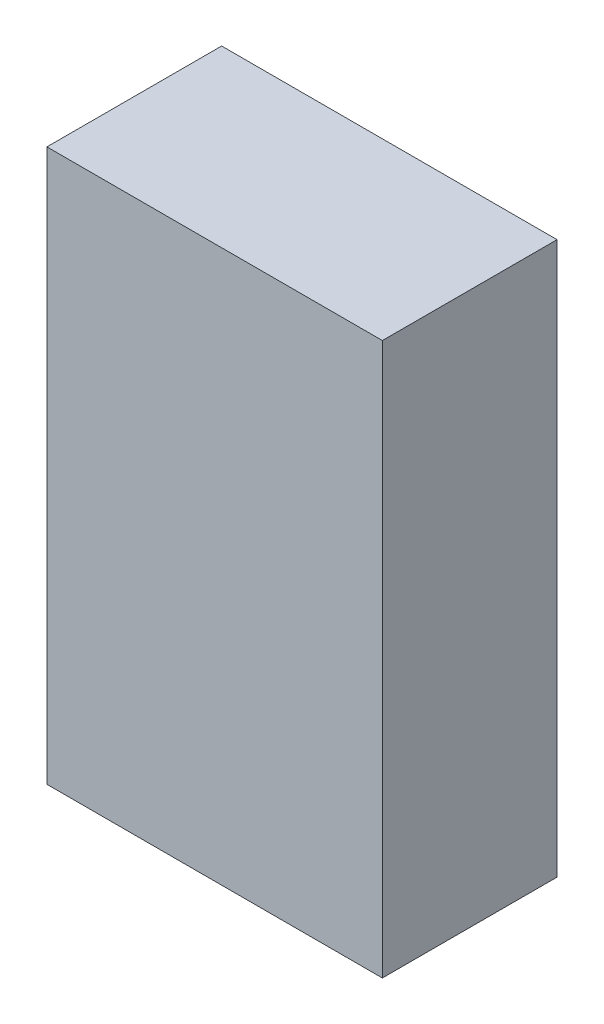
ISO-10303-21;
HEADER;
FILE_DESCRIPTION(('STEP AP214'),'2;1');
FILE_NAME('part.step','',(''),(''),'','','');
FILE_SCHEMA(('AUTOMOTIVE_DESIGN { 1 0 10303 214 1 1 1 1 }'));
ENDSEC;
DATA;
#1=APPLICATION_CONTEXT('core data for automotive mechanical design processes');
#2=APPLICATION_PROTOCOL_DEFINITION('international standard','automotive_design',2000,#1);
#3=PRODUCT_CONTEXT('',#1,'mechanical');
#4=PRODUCT('Part','Part','',(#3));
#5=PRODUCT_RELATED_PRODUCT_CATEGORY('part','',(#4));
#6=PRODUCT_DEFINITION_FORMATION('','',#4);
#7=PRODUCT_DEFINITION_CONTEXT('part definition',#1,'design');
#8=PRODUCT_DEFINITION('design','',#6,#7);
#9=PRODUCT_DEFINITION_SHAPE('','',#8);
#10=(LENGTH_UNIT() NAMED_UNIT(*) SI_UNIT(.MILLI.,.METRE.));
#11=(NAMED_UNIT(*) PLANE_ANGLE_UNIT() SI_UNIT($,.RADIAN.));
#12=(NAMED_UNIT(*) SI_UNIT($,.STERADIAN.) SOLID_ANGLE_UNIT());
#13=UNCERTAINTY_MEASURE_WITH_UNIT(LENGTH_MEASURE(1.E-05),#10,'distance_accuracy_value','');
#14=(GEOMETRIC_REPRESENTATION_CONTEXT(3) GLOBAL_UNCERTAINTY_ASSIGNED_CONTEXT((#13)) GLOBAL_UNIT_ASSIGNED_CONTEXT((#10,
#11,#12)) REPRESENTATION_CONTEXT('',''));
#15=CARTESIAN_POINT('',(0.,0.,0.));
#16=DIRECTION('',(0.,0.,1.));
#17=DIRECTION('',(1.,0.,0.));
#18=AXIS2_PLACEMENT_3D('',#15,#16,#17);
#19=CARTESIAN_POINT('',(-0.6096,-1.0033,0.635));
#20=DIRECTION('',(0.,0.,1.));
#21=DIRECTION('',(1.,0.,0.));
#22=AXIS2_PLACEMENT_3D('',#19,#20,#21);
#23=PLANE('',#22);
#24=DIRECTION('',(1.,0.,0.));
#25=VECTOR('',#24,1.);
#26=CARTESIAN_POINT('',(-0.6096,1.0033,0.635));
#27=LINE('',#26,#25);
#28=CARTESIAN_POINT('',(-0.6096,1.0033,0.635));
#29=VERTEX_POINT('',#28);
#30=CARTESIAN_POINT('',(0.6096,1.0033,0.635));
#31=VERTEX_POINT('',#30);
#32=EDGE_CURVE('E53',#29,#31,#27,.T.);
#33=ORIENTED_EDGE('',*,*,#32,.F.);
#34=DIRECTION('',(0.,1.,0.));
#35=VECTOR('',#34,1.);
#36=CARTESIAN_POINT('',(-0.6096,-1.0033,0.635));
#37=LINE('',#36,#35);
#38=CARTESIAN_POINT('',(-0.6096,-1.0033,0.635));
#39=VERTEX_POINT('',#38);
#40=EDGE_CURVE('E68',#39,#29,#37,.T.);
#41=ORIENTED_EDGE('',*,*,#40,.F.);
#42=DIRECTION('',(1.,0.,0.));
#43=VECTOR('',#42,1.);
#44=CARTESIAN_POINT('',(0.6096,-1.0033,0.635));
#45=LINE('',#44,#43);
#46=CARTESIAN_POINT('',(0.6096,-1.0033,0.635));
#47=VERTEX_POINT('',#46);
#48=EDGE_CURVE('E20',#47,#39,#45,.F.);
#49=ORIENTED_EDGE('',*,*,#48,.F.);
#50=DIRECTION('',(0.,1.,0.));
#51=VECTOR('',#50,1.);
#52=CARTESIAN_POINT('',(0.6096,1.0033,0.635));
#53=LINE('',#52,#51);
#54=EDGE_CURVE('E58',#31,#47,#53,.F.);
#55=ORIENTED_EDGE('',*,*,#54,.F.);
#56=EDGE_LOOP('',(#33,#41,#49,#55));
#57=FACE_BOUND('',#56,.T.);
#58=ADVANCED_FACE('F17',(#57),#23,.T.);
#59=CARTESIAN_POINT('',(0.6096,-1.0033,0.));
#60=DIRECTION('',(0.,-1.,0.));
#61=DIRECTION('',(0.,0.,-1.));
#62=AXIS2_PLACEMENT_3D('',#59,#60,#61);
#63=PLANE('',#62);
#64=DIRECTION('',(0.,0.,1.));
#65=VECTOR('',#64,1.);
#66=CARTESIAN_POINT('',(-0.6096,-1.0033,0.));
#67=LINE('',#66,#65);
#68=CARTESIAN_POINT('',(-0.6096,-1.0033,0.));
#69=VERTEX_POINT('',#68);
#70=EDGE_CURVE('E79',#69,#39,#67,.T.);
#71=ORIENTED_EDGE('',*,*,#70,.F.);
#72=DIRECTION('',(1.,0.,0.));
#73=VECTOR('',#72,1.);
#74=CARTESIAN_POINT('',(-0.6096,-1.0033,0.));
#75=LINE('',#74,#73);
#76=CARTESIAN_POINT('',(0.6096,-1.0033,0.));
#77=VERTEX_POINT('',#76);
#78=EDGE_CURVE('E74',#69,#77,#75,.T.);
#79=ORIENTED_EDGE('',*,*,#78,.T.);
#80=DIRECTION('',(0.,0.,-1.));
#81=VECTOR('',#80,1.);
#82=CARTESIAN_POINT('',(0.6096,-1.0033,0.));
#83=LINE('',#82,#81);
#84=EDGE_CURVE('E63',#47,#77,#83,.T.);
#85=ORIENTED_EDGE('',*,*,#84,.F.);
#86=ORIENTED_EDGE('',*,*,#48,.T.);
#87=EDGE_LOOP('',(#71,#79,#85,#86));
#88=FACE_BOUND('',#87,.T.);
#89=ADVANCED_FACE('F73',(#88),#63,.T.);
#90=CARTESIAN_POINT('',(0.6096,1.0033,0.));
#91=DIRECTION('',(1.,0.,0.));
#92=DIRECTION('',(0.,0.,-1.));
#93=AXIS2_PLACEMENT_3D('',#90,#91,#92);
#94=PLANE('',#93);
#95=ORIENTED_EDGE('',*,*,#84,.T.);
#96=DIRECTION('',(0.,1.,0.));
#97=VECTOR('',#96,1.);
#98=CARTESIAN_POINT('',(0.6096,-1.0033,0.));
#99=LINE('',#98,#97);
#100=CARTESIAN_POINT('',(0.6096,1.0033,0.));
#101=VERTEX_POINT('',#100);
#102=EDGE_CURVE('E84',#77,#101,#99,.T.);
#103=ORIENTED_EDGE('',*,*,#102,.T.);
#104=DIRECTION('',(0.,0.,1.));
#105=VECTOR('',#104,1.);
#106=CARTESIAN_POINT('',(0.6096,1.0033,0.));
#107=LINE('',#106,#105);
#108=EDGE_CURVE('E65',#31,#101,#107,.F.);
#109=ORIENTED_EDGE('',*,*,#108,.F.);
#110=ORIENTED_EDGE('',*,*,#54,.T.);
#111=EDGE_LOOP('',(#95,#103,#109,#110));
#112=FACE_BOUND('',#111,.T.);
#113=ADVANCED_FACE('F60',(#112),#94,.T.);
#114=CARTESIAN_POINT('',(-0.6096,1.0033,0.));
#115=DIRECTION('',(0.,1.,0.));
#116=DIRECTION('',(0.,0.,1.));
#117=AXIS2_PLACEMENT_3D('',#114,#115,#116);
#118=PLANE('',#117);
#119=ORIENTED_EDGE('',*,*,#108,.T.);
#120=DIRECTION('',(1.,0.,0.));
#121=VECTOR('',#120,1.);
#122=CARTESIAN_POINT('',(-0.6096,1.0033,0.));
#123=LINE('',#122,#121);
#124=CARTESIAN_POINT('',(-0.6096,1.0033,0.));
#125=VERTEX_POINT('',#124);
#126=EDGE_CURVE('E26',#101,#125,#123,.F.);
#127=ORIENTED_EDGE('',*,*,#126,.T.);
#128=DIRECTION('',(0.,0.,1.));
#129=VECTOR('',#128,1.);
#130=CARTESIAN_POINT('',(-0.6096,1.0033,0.));
#131=LINE('',#130,#129);
#132=EDGE_CURVE('E34',#29,#125,#131,.F.);
#133=ORIENTED_EDGE('',*,*,#132,.F.);
#134=ORIENTED_EDGE('',*,*,#32,.T.);
#135=EDGE_LOOP('',(#119,#127,#133,#134));
#136=FACE_BOUND('',#135,.T.);
#137=ADVANCED_FACE('F88',(#136),#118,.T.);
#138=CARTESIAN_POINT('',(-0.6096,-1.0033,0.));
#139=DIRECTION('',(-1.,0.,0.));
#140=DIRECTION('',(0.,0.,1.));
#141=AXIS2_PLACEMENT_3D('',#138,#139,#140);
#142=PLANE('',#141);
#143=ORIENTED_EDGE('',*,*,#132,.T.);
#144=DIRECTION('',(0.,1.,0.));
#145=VECTOR('',#144,1.);
#146=CARTESIAN_POINT('',(-0.6096,-1.0033,0.));
#147=LINE('',#146,#145);
#148=EDGE_CURVE('E11',#125,#69,#147,.F.);
#149=ORIENTED_EDGE('',*,*,#148,.T.);
#150=ORIENTED_EDGE('',*,*,#70,.T.);
#151=ORIENTED_EDGE('',*,*,#40,.T.);
#152=EDGE_LOOP('',(#143,#149,#150,#151));
#153=FACE_BOUND('',#152,.T.);
#154=ADVANCED_FACE('F91',(#153),#142,.T.);
#155=CARTESIAN_POINT('',(-0.6096,-1.0033,0.));
#156=DIRECTION('',(0.,0.,1.));
#157=DIRECTION('',(1.,0.,0.));
#158=AXIS2_PLACEMENT_3D('',#155,#156,#157);
#159=PLANE('',#158);
#160=ORIENTED_EDGE('',*,*,#126,.F.);
#161=ORIENTED_EDGE('',*,*,#102,.F.);
#162=ORIENTED_EDGE('',*,*,#78,.F.);
#163=ORIENTED_EDGE('',*,*,#148,.F.);
#164=EDGE_LOOP('',(#160,#161,#162,#163));
#165=FACE_BOUND('',#164,.T.);
#166=ADVANCED_FACE('F90',(#165),#159,.F.);
#167=CLOSED_SHELL('',(#58,#89,#113,#137,#154,#166));
#168=MANIFOLD_SOLID_BREP('B1',#167);
#169=ADVANCED_BREP_SHAPE_REPRESENTATION('',(#18,#168),#14);
#170=SHAPE_DEFINITION_REPRESENTATION(#9,#169);
ENDSEC;
END-ISO-10303-21;
